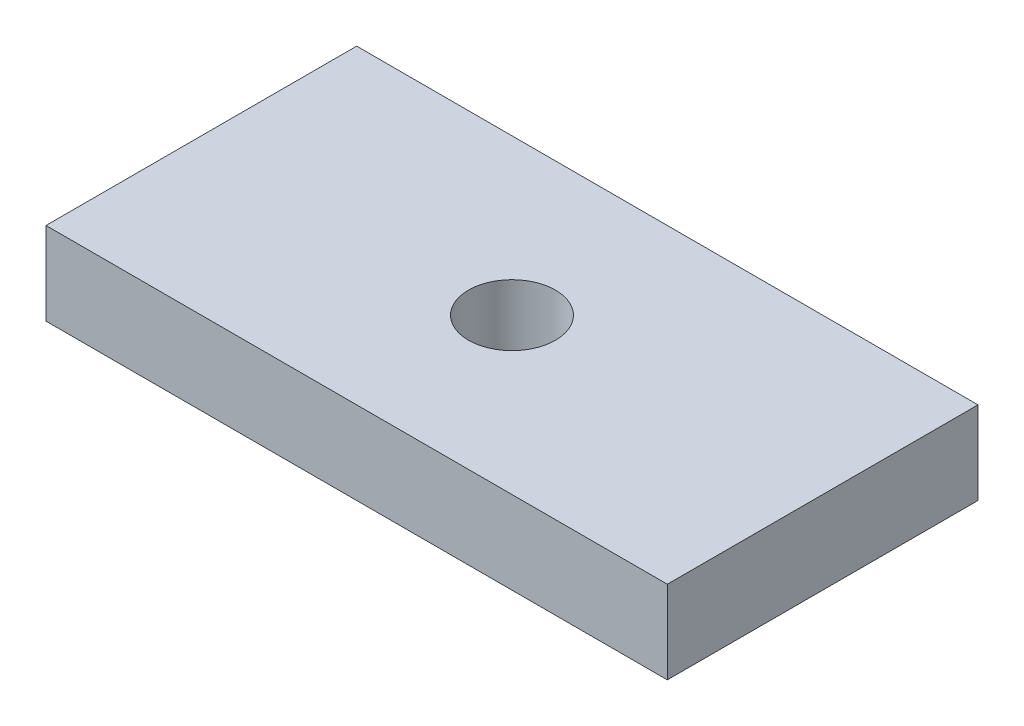
ISO-10303-21;
HEADER;
FILE_DESCRIPTION(('STEP AP214'),'2;1');
FILE_NAME('part.step','',(''),(''),'','','');
FILE_SCHEMA(('AUTOMOTIVE_DESIGN { 1 0 10303 214 1 1 1 1 }'));
ENDSEC;
DATA;
#1=APPLICATION_CONTEXT('core data for automotive mechanical design processes');
#2=APPLICATION_PROTOCOL_DEFINITION('international standard','automotive_design',2000,#1);
#3=PRODUCT_CONTEXT('',#1,'mechanical');
#4=PRODUCT('Part','Part','',(#3));
#5=PRODUCT_RELATED_PRODUCT_CATEGORY('part','',(#4));
#6=PRODUCT_DEFINITION_FORMATION('','',#4);
#7=PRODUCT_DEFINITION_CONTEXT('part definition',#1,'design');
#8=PRODUCT_DEFINITION('design','',#6,#7);
#9=PRODUCT_DEFINITION_SHAPE('','',#8);
#10=(LENGTH_UNIT() NAMED_UNIT(*) SI_UNIT(.MILLI.,.METRE.));
#11=(NAMED_UNIT(*) PLANE_ANGLE_UNIT() SI_UNIT($,.RADIAN.));
#12=(NAMED_UNIT(*) SI_UNIT($,.STERADIAN.) SOLID_ANGLE_UNIT());
#13=UNCERTAINTY_MEASURE_WITH_UNIT(LENGTH_MEASURE(1.E-05),#10,'distance_accuracy_value','');
#14=(GEOMETRIC_REPRESENTATION_CONTEXT(3) GLOBAL_UNCERTAINTY_ASSIGNED_CONTEXT((#13)) GLOBAL_UNIT_ASSIGNED_CONTEXT((#10,
#11,#12)) REPRESENTATION_CONTEXT('',''));
#15=CARTESIAN_POINT('',(0.,0.,0.));
#16=DIRECTION('',(0.,0.,1.));
#17=DIRECTION('',(1.,0.,0.));
#18=AXIS2_PLACEMENT_3D('',#15,#16,#17);
#19=CARTESIAN_POINT('',(0.,2.,0.));
#20=DIRECTION('',(0.,1.,0.));
#21=DIRECTION('',(0.,0.,1.));
#22=AXIS2_PLACEMENT_3D('',#19,#20,#21);
#23=PLANE('',#22);
#24=DIRECTION('',(0.,0.,-1.));
#25=VECTOR('',#24,1.);
#26=CARTESIAN_POINT('',(15.,2.,-7.5));
#27=LINE('',#26,#25);
#28=CARTESIAN_POINT('',(15.,2.,7.5));
#29=VERTEX_POINT('',#28);
#30=CARTESIAN_POINT('',(15.,2.,-7.5));
#31=VERTEX_POINT('',#30);
#32=EDGE_CURVE('E85',#29,#31,#27,.T.);
#33=ORIENTED_EDGE('',*,*,#32,.T.);
#34=DIRECTION('',(-1.,0.,0.));
#35=VECTOR('',#34,1.);
#36=CARTESIAN_POINT('',(-15.,2.,-7.5));
#37=LINE('',#36,#35);
#38=CARTESIAN_POINT('',(-15.,2.,-7.5));
#39=VERTEX_POINT('',#38);
#40=EDGE_CURVE('E80',#31,#39,#37,.T.);
#41=ORIENTED_EDGE('',*,*,#40,.T.);
#42=DIRECTION('',(0.,0.,1.));
#43=VECTOR('',#42,1.);
#44=CARTESIAN_POINT('',(-15.,2.,-7.5));
#45=LINE('',#44,#43);
#46=CARTESIAN_POINT('',(-15.,2.,7.5));
#47=VERTEX_POINT('',#46);
#48=EDGE_CURVE('E83',#39,#47,#45,.T.);
#49=ORIENTED_EDGE('',*,*,#48,.T.);
#50=DIRECTION('',(1.,0.,0.));
#51=VECTOR('',#50,1.);
#52=CARTESIAN_POINT('',(-15.,2.,7.5));
#53=LINE('',#52,#51);
#54=EDGE_CURVE('E50',#47,#29,#53,.T.);
#55=ORIENTED_EDGE('',*,*,#54,.T.);
#56=EDGE_LOOP('',(#33,#41,#49,#55));
#57=FACE_BOUND('',#56,.T.);
#58=CARTESIAN_POINT('',(0.,2.,0.));
#59=DIRECTION('',(0.,1.,0.));
#60=DIRECTION('',(0.,0.,1.));
#61=AXIS2_PLACEMENT_3D('',#58,#59,#60);
#62=CIRCLE('',#61,2.1);
#63=CARTESIAN_POINT('',(0.,2.,2.1));
#64=VERTEX_POINT('',#63);
#65=EDGE_CURVE('E100',#64,#64,#62,.T.);
#66=ORIENTED_EDGE('',*,*,#65,.F.);
#67=EDGE_LOOP('',(#66));
#68=FACE_BOUND('',#67,.T.);
#69=ADVANCED_FACE('F33',(#57,#68),#23,.T.);
#70=CARTESIAN_POINT('',(0.,-2.,0.));
#71=DIRECTION('',(0.,1.,0.));
#72=DIRECTION('',(0.,0.,1.));
#73=AXIS2_PLACEMENT_3D('',#70,#71,#72);
#74=PLANE('',#73);
#75=DIRECTION('',(0.,0.,-1.));
#76=VECTOR('',#75,1.);
#77=CARTESIAN_POINT('',(15.,-2.,-7.5));
#78=LINE('',#77,#76);
#79=CARTESIAN_POINT('',(15.,-2.,7.5));
#80=VERTEX_POINT('',#79);
#81=CARTESIAN_POINT('',(15.,-2.,-7.5));
#82=VERTEX_POINT('',#81);
#83=EDGE_CURVE('E97',#80,#82,#78,.T.);
#84=ORIENTED_EDGE('',*,*,#83,.F.);
#85=DIRECTION('',(1.,0.,0.));
#86=VECTOR('',#85,1.);
#87=CARTESIAN_POINT('',(-15.,-2.,7.5));
#88=LINE('',#87,#86);
#89=CARTESIAN_POINT('',(-15.,-2.,7.5));
#90=VERTEX_POINT('',#89);
#91=EDGE_CURVE('E73',#90,#80,#88,.T.);
#92=ORIENTED_EDGE('',*,*,#91,.F.);
#93=DIRECTION('',(0.,0.,1.));
#94=VECTOR('',#93,1.);
#95=CARTESIAN_POINT('',(-15.,-2.,-7.5));
#96=LINE('',#95,#94);
#97=CARTESIAN_POINT('',(-15.,-2.,-7.5));
#98=VERTEX_POINT('',#97);
#99=EDGE_CURVE('E67',#98,#90,#96,.T.);
#100=ORIENTED_EDGE('',*,*,#99,.F.);
#101=DIRECTION('',(-1.,0.,0.));
#102=VECTOR('',#101,1.);
#103=CARTESIAN_POINT('',(-15.,-2.,-7.5));
#104=LINE('',#103,#102);
#105=EDGE_CURVE('E89',#82,#98,#104,.T.);
#106=ORIENTED_EDGE('',*,*,#105,.F.);
#107=EDGE_LOOP('',(#84,#92,#100,#106));
#108=FACE_BOUND('',#107,.T.);
#109=CARTESIAN_POINT('',(0.,-2.,0.));
#110=DIRECTION('',(0.,1.,0.));
#111=DIRECTION('',(0.,0.,1.));
#112=AXIS2_PLACEMENT_3D('',#109,#110,#111);
#113=CIRCLE('',#112,2.1);
#114=CARTESIAN_POINT('',(0.,-2.,2.1));
#115=VERTEX_POINT('',#114);
#116=EDGE_CURVE('E112',#115,#115,#113,.T.);
#117=ORIENTED_EDGE('',*,*,#116,.T.);
#118=EDGE_LOOP('',(#117));
#119=FACE_BOUND('',#118,.T.);
#120=ADVANCED_FACE('F108',(#108,#119),#74,.F.);
#121=CARTESIAN_POINT('',(15.,2.,-7.5));
#122=DIRECTION('',(-1.,0.,0.));
#123=DIRECTION('',(0.,0.,1.));
#124=AXIS2_PLACEMENT_3D('',#121,#122,#123);
#125=PLANE('',#124);
#126=ORIENTED_EDGE('',*,*,#83,.T.);
#127=DIRECTION('',(0.,-1.,0.));
#128=VECTOR('',#127,1.);
#129=CARTESIAN_POINT('',(15.,2.,-7.5));
#130=LINE('',#129,#128);
#131=EDGE_CURVE('E11',#31,#82,#130,.T.);
#132=ORIENTED_EDGE('',*,*,#131,.F.);
#133=ORIENTED_EDGE('',*,*,#32,.F.);
#134=DIRECTION('',(0.,-1.,0.));
#135=VECTOR('',#134,1.);
#136=CARTESIAN_POINT('',(15.,2.,7.5));
#137=LINE('',#136,#135);
#138=EDGE_CURVE('E93',#29,#80,#137,.T.);
#139=ORIENTED_EDGE('',*,*,#138,.T.);
#140=EDGE_LOOP('',(#126,#132,#133,#139));
#141=FACE_BOUND('',#140,.T.);
#142=ADVANCED_FACE('F35',(#141),#125,.F.);
#143=CARTESIAN_POINT('',(-15.,2.,-7.5));
#144=DIRECTION('',(0.,0.,1.));
#145=DIRECTION('',(1.,0.,0.));
#146=AXIS2_PLACEMENT_3D('',#143,#144,#145);
#147=PLANE('',#146);
#148=ORIENTED_EDGE('',*,*,#105,.T.);
#149=DIRECTION('',(0.,-1.,0.));
#150=VECTOR('',#149,1.);
#151=CARTESIAN_POINT('',(-15.,2.,-7.5));
#152=LINE('',#151,#150);
#153=EDGE_CURVE('E42',#39,#98,#152,.T.);
#154=ORIENTED_EDGE('',*,*,#153,.F.);
#155=ORIENTED_EDGE('',*,*,#40,.F.);
#156=ORIENTED_EDGE('',*,*,#131,.T.);
#157=EDGE_LOOP('',(#148,#154,#155,#156));
#158=FACE_BOUND('',#157,.T.);
#159=ADVANCED_FACE('F88',(#158),#147,.F.);
#160=CARTESIAN_POINT('',(-15.,2.,-7.5));
#161=DIRECTION('',(1.,0.,0.));
#162=DIRECTION('',(0.,0.,-1.));
#163=AXIS2_PLACEMENT_3D('',#160,#161,#162);
#164=PLANE('',#163);
#165=ORIENTED_EDGE('',*,*,#99,.T.);
#166=DIRECTION('',(0.,-1.,0.));
#167=VECTOR('',#166,1.);
#168=CARTESIAN_POINT('',(-15.,2.,7.5));
#169=LINE('',#168,#167);
#170=EDGE_CURVE('E90',#47,#90,#169,.T.);
#171=ORIENTED_EDGE('',*,*,#170,.F.);
#172=ORIENTED_EDGE('',*,*,#48,.F.);
#173=ORIENTED_EDGE('',*,*,#153,.T.);
#174=EDGE_LOOP('',(#165,#171,#172,#173));
#175=FACE_BOUND('',#174,.T.);
#176=ADVANCED_FACE('F91',(#175),#164,.F.);
#177=CARTESIAN_POINT('',(-15.,2.,7.5));
#178=DIRECTION('',(0.,0.,-1.));
#179=DIRECTION('',(-1.,0.,0.));
#180=AXIS2_PLACEMENT_3D('',#177,#178,#179);
#181=PLANE('',#180);
#182=ORIENTED_EDGE('',*,*,#91,.T.);
#183=ORIENTED_EDGE('',*,*,#138,.F.);
#184=ORIENTED_EDGE('',*,*,#54,.F.);
#185=ORIENTED_EDGE('',*,*,#170,.T.);
#186=EDGE_LOOP('',(#182,#183,#184,#185));
#187=FACE_BOUND('',#186,.T.);
#188=ADVANCED_FACE('F105',(#187),#181,.F.);
#189=CARTESIAN_POINT('',(0.,2.,0.));
#190=DIRECTION('',(0.,-1.,0.));
#191=DIRECTION('',(0.,0.,-1.));
#192=AXIS2_PLACEMENT_3D('',#189,#190,#191);
#193=CYLINDRICAL_SURFACE('',#192,2.1);
#194=ORIENTED_EDGE('',*,*,#65,.T.);
#195=EDGE_LOOP('',(#194));
#196=FACE_BOUND('',#195,.T.);
#197=ORIENTED_EDGE('',*,*,#116,.F.);
#198=EDGE_LOOP('',(#197));
#199=FACE_BOUND('',#198,.T.);
#200=ADVANCED_FACE('F118',(#196,#199),#193,.F.);
#201=CLOSED_SHELL('',(#69,#120,#142,#159,#176,#188,#200));
#202=MANIFOLD_SOLID_BREP('B2',#201);
#203=ADVANCED_BREP_SHAPE_REPRESENTATION('',(#18,#202),#14);
#204=SHAPE_DEFINITION_REPRESENTATION(#9,#203);
ENDSEC;
END-ISO-10303-21;
